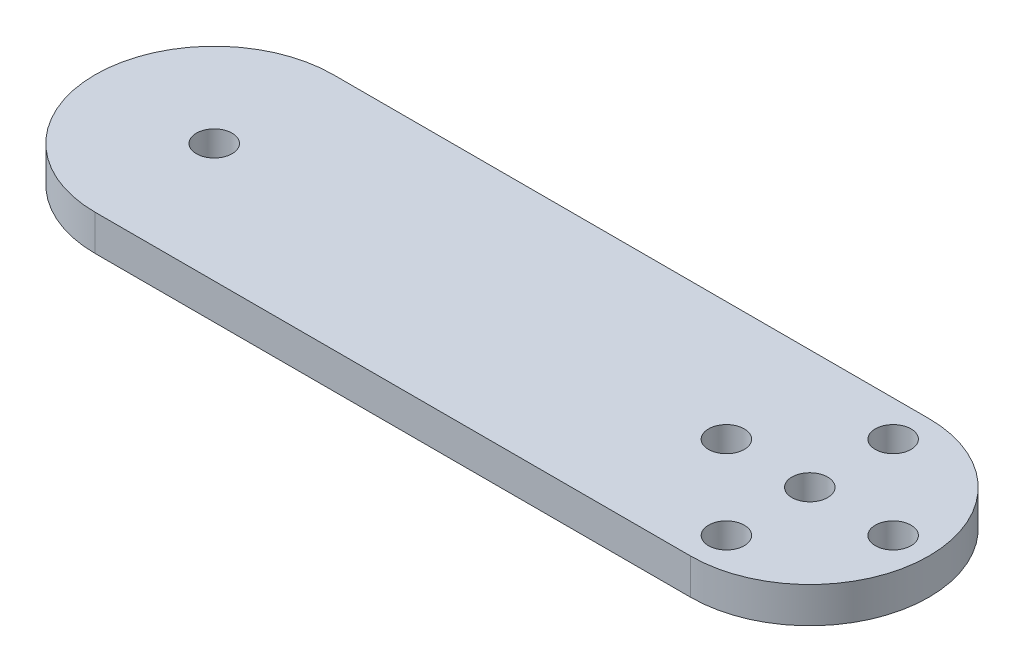
ISO-10303-21;
HEADER;
FILE_DESCRIPTION(('STEP AP214'),'2;1');
FILE_NAME('part.step','',(''),(''),'','','');
FILE_SCHEMA(('AUTOMOTIVE_DESIGN { 1 0 10303 214 1 1 1 1 }'));
ENDSEC;
DATA;
#1=APPLICATION_CONTEXT('core data for automotive mechanical design processes');
#2=APPLICATION_PROTOCOL_DEFINITION('international standard','automotive_design',2000,#1);
#3=PRODUCT_CONTEXT('',#1,'mechanical');
#4=PRODUCT('Part','Part','',(#3));
#5=PRODUCT_RELATED_PRODUCT_CATEGORY('part','',(#4));
#6=PRODUCT_DEFINITION_FORMATION('','',#4);
#7=PRODUCT_DEFINITION_CONTEXT('part definition',#1,'design');
#8=PRODUCT_DEFINITION('design','',#6,#7);
#9=PRODUCT_DEFINITION_SHAPE('','',#8);
#10=(LENGTH_UNIT() NAMED_UNIT(*) SI_UNIT(.MILLI.,.METRE.));
#11=(NAMED_UNIT(*) PLANE_ANGLE_UNIT() SI_UNIT($,.RADIAN.));
#12=(NAMED_UNIT(*) SI_UNIT($,.STERADIAN.) SOLID_ANGLE_UNIT());
#13=UNCERTAINTY_MEASURE_WITH_UNIT(LENGTH_MEASURE(1.E-05),#10,'distance_accuracy_value','');
#14=(GEOMETRIC_REPRESENTATION_CONTEXT(3) GLOBAL_UNCERTAINTY_ASSIGNED_CONTEXT((#13)) GLOBAL_UNIT_ASSIGNED_CONTEXT((#10,
#11,#12)) REPRESENTATION_CONTEXT('',''));
#15=CARTESIAN_POINT('',(0.,0.,0.));
#16=DIRECTION('',(0.,0.,1.));
#17=DIRECTION('',(1.,0.,0.));
#18=AXIS2_PLACEMENT_3D('',#15,#16,#17);
#19=CARTESIAN_POINT('',(0.,3.,-10.));
#20=DIRECTION('',(0.,1.,0.));
#21=DIRECTION('',(0.,0.,1.));
#22=AXIS2_PLACEMENT_3D('',#19,#20,#21);
#23=PLANE('',#22);
#24=CARTESIAN_POINT('',(-7.,3.,-10.));
#25=DIRECTION('',(0.,-1.,0.));
#26=DIRECTION('',(0.,0.,-1.));
#27=AXIS2_PLACEMENT_3D('',#24,#25,#26);
#28=CIRCLE('',#27,1.5);
#29=CARTESIAN_POINT('',(-7.,3.,-11.5));
#30=VERTEX_POINT('',#29);
#31=EDGE_CURVE('E226',#30,#30,#28,.T.);
#32=ORIENTED_EDGE('',*,*,#31,.T.);
#33=EDGE_LOOP('',(#32));
#34=FACE_BOUND('',#33,.T.);
#35=CARTESIAN_POINT('',(7.,3.,-10.));
#36=DIRECTION('',(0.,1.,0.));
#37=DIRECTION('',(0.,0.,1.));
#38=AXIS2_PLACEMENT_3D('',#35,#36,#37);
#39=CIRCLE('',#38,1.5);
#40=CARTESIAN_POINT('',(7.,3.,-8.5));
#41=VERTEX_POINT('',#40);
#42=EDGE_CURVE('E214',#41,#41,#39,.T.);
#43=ORIENTED_EDGE('',*,*,#42,.F.);
#44=EDGE_LOOP('',(#43));
#45=FACE_BOUND('',#44,.T.);
#46=CARTESIAN_POINT('',(-50.,3.,-9.99999999999999));
#47=DIRECTION('',(0.,1.,0.));
#48=DIRECTION('',(0.,0.,1.));
#49=AXIS2_PLACEMENT_3D('',#46,#47,#48);
#50=CIRCLE('',#49,1.5);
#51=CARTESIAN_POINT('',(-50.,3.,-8.49999999999999));
#52=VERTEX_POINT('',#51);
#53=EDGE_CURVE('E189',#52,#52,#50,.T.);
#54=ORIENTED_EDGE('',*,*,#53,.F.);
#55=EDGE_LOOP('',(#54));
#56=FACE_BOUND('',#55,.T.);
#57=CARTESIAN_POINT('',(0.,3.,-10.));
#58=DIRECTION('',(0.,1.,0.));
#59=DIRECTION('',(0.,0.,1.));
#60=AXIS2_PLACEMENT_3D('',#57,#58,#59);
#61=CIRCLE('',#60,10.);
#62=CARTESIAN_POINT('',(0.,3.,0.));
#63=VERTEX_POINT('',#62);
#64=CARTESIAN_POINT('',(0.,3.,-20.));
#65=VERTEX_POINT('',#64);
#66=EDGE_CURVE('E173',#63,#65,#61,.T.);
#67=ORIENTED_EDGE('',*,*,#66,.T.);
#68=DIRECTION('',(-1.,0.,0.));
#69=VECTOR('',#68,1.);
#70=CARTESIAN_POINT('',(0.,3.,-20.));
#71=LINE('',#70,#69);
#72=CARTESIAN_POINT('',(-50.,3.,-20.));
#73=VERTEX_POINT('',#72);
#74=EDGE_CURVE('E165',#65,#73,#71,.T.);
#75=ORIENTED_EDGE('',*,*,#74,.T.);
#76=CARTESIAN_POINT('',(-50.,3.,-9.99999999999999));
#77=DIRECTION('',(0.,-1.,0.));
#78=DIRECTION('',(0.,0.,-1.));
#79=AXIS2_PLACEMENT_3D('',#76,#77,#78);
#80=CIRCLE('',#79,10.);
#81=CARTESIAN_POINT('',(-50.,3.,0.));
#82=VERTEX_POINT('',#81);
#83=EDGE_CURVE('E172',#82,#73,#80,.T.);
#84=ORIENTED_EDGE('',*,*,#83,.F.);
#85=DIRECTION('',(-1.,0.,0.));
#86=VECTOR('',#85,1.);
#87=CARTESIAN_POINT('',(0.,3.,0.));
#88=LINE('',#87,#86);
#89=EDGE_CURVE('E182',#63,#82,#88,.T.);
#90=ORIENTED_EDGE('',*,*,#89,.F.);
#91=EDGE_LOOP('',(#67,#75,#84,#90));
#92=FACE_BOUND('',#91,.T.);
#93=CARTESIAN_POINT('',(0.,3.,-3.));
#94=DIRECTION('',(0.,-1.,0.));
#95=DIRECTION('',(0.,0.,-1.));
#96=AXIS2_PLACEMENT_3D('',#93,#94,#95);
#97=CIRCLE('',#96,1.5);
#98=CARTESIAN_POINT('',(0.,3.,-4.5));
#99=VERTEX_POINT('',#98);
#100=EDGE_CURVE('E202',#99,#99,#97,.T.);
#101=ORIENTED_EDGE('',*,*,#100,.T.);
#102=EDGE_LOOP('',(#101));
#103=FACE_BOUND('',#102,.T.);
#104=CARTESIAN_POINT('',(0.,3.,-10.));
#105=DIRECTION('',(0.,1.,0.));
#106=DIRECTION('',(0.,0.,1.));
#107=AXIS2_PLACEMENT_3D('',#104,#105,#106);
#108=CIRCLE('',#107,1.5);
#109=CARTESIAN_POINT('',(0.,3.,-8.5));
#110=VERTEX_POINT('',#109);
#111=EDGE_CURVE('E208',#110,#110,#108,.T.);
#112=ORIENTED_EDGE('',*,*,#111,.F.);
#113=EDGE_LOOP('',(#112));
#114=FACE_BOUND('',#113,.T.);
#115=CARTESIAN_POINT('',(0.,3.,-17.));
#116=DIRECTION('',(0.,1.,0.));
#117=DIRECTION('',(0.,0.,1.));
#118=AXIS2_PLACEMENT_3D('',#115,#116,#117);
#119=CIRCLE('',#118,1.5);
#120=CARTESIAN_POINT('',(0.,3.,-15.5));
#121=VERTEX_POINT('',#120);
#122=EDGE_CURVE('E220',#121,#121,#119,.T.);
#123=ORIENTED_EDGE('',*,*,#122,.F.);
#124=EDGE_LOOP('',(#123));
#125=FACE_BOUND('',#124,.T.);
#126=ADVANCED_FACE('F123',(#34,#45,#56,#92,#103,#114,#125),#23,.T.);
#127=CARTESIAN_POINT('',(0.,0.,-10.));
#128=DIRECTION('',(0.,1.,0.));
#129=DIRECTION('',(0.,0.,1.));
#130=AXIS2_PLACEMENT_3D('',#127,#128,#129);
#131=PLANE('',#130);
#132=CARTESIAN_POINT('',(-7.,0.,-10.));
#133=DIRECTION('',(0.,-1.,0.));
#134=DIRECTION('',(0.,0.,-1.));
#135=AXIS2_PLACEMENT_3D('',#132,#133,#134);
#136=CIRCLE('',#135,1.5);
#137=CARTESIAN_POINT('',(-7.,0.,-11.5));
#138=VERTEX_POINT('',#137);
#139=EDGE_CURVE('E229',#138,#138,#136,.T.);
#140=ORIENTED_EDGE('',*,*,#139,.F.);
#141=EDGE_LOOP('',(#140));
#142=FACE_BOUND('',#141,.T.);
#143=CARTESIAN_POINT('',(0.,0.,-3.));
#144=DIRECTION('',(0.,-1.,0.));
#145=DIRECTION('',(0.,0.,-1.));
#146=AXIS2_PLACEMENT_3D('',#143,#144,#145);
#147=CIRCLE('',#146,1.5);
#148=CARTESIAN_POINT('',(0.,0.,-4.5));
#149=VERTEX_POINT('',#148);
#150=EDGE_CURVE('E205',#149,#149,#147,.T.);
#151=ORIENTED_EDGE('',*,*,#150,.F.);
#152=EDGE_LOOP('',(#151));
#153=FACE_BOUND('',#152,.T.);
#154=CARTESIAN_POINT('',(0.,0.,-10.));
#155=DIRECTION('',(0.,1.,0.));
#156=DIRECTION('',(0.,0.,1.));
#157=AXIS2_PLACEMENT_3D('',#154,#155,#156);
#158=CIRCLE('',#157,10.);
#159=CARTESIAN_POINT('',(0.,0.,0.));
#160=VERTEX_POINT('',#159);
#161=CARTESIAN_POINT('',(0.,0.,-20.));
#162=VERTEX_POINT('',#161);
#163=EDGE_CURVE('E187',#160,#162,#158,.T.);
#164=ORIENTED_EDGE('',*,*,#163,.F.);
#165=DIRECTION('',(-1.,0.,0.));
#166=VECTOR('',#165,1.);
#167=CARTESIAN_POINT('',(0.,0.,0.));
#168=LINE('',#167,#166);
#169=CARTESIAN_POINT('',(-50.,0.,0.));
#170=VERTEX_POINT('',#169);
#171=EDGE_CURVE('E193',#160,#170,#168,.T.);
#172=ORIENTED_EDGE('',*,*,#171,.T.);
#173=CARTESIAN_POINT('',(-50.,0.,-9.99999999999999));
#174=DIRECTION('',(0.,-1.,0.));
#175=DIRECTION('',(0.,0.,-1.));
#176=AXIS2_PLACEMENT_3D('',#173,#174,#175);
#177=CIRCLE('',#176,10.);
#178=CARTESIAN_POINT('',(-50.,0.,-20.));
#179=VERTEX_POINT('',#178);
#180=EDGE_CURVE('E191',#170,#179,#177,.T.);
#181=ORIENTED_EDGE('',*,*,#180,.T.);
#182=DIRECTION('',(-1.,0.,0.));
#183=VECTOR('',#182,1.);
#184=CARTESIAN_POINT('',(0.,0.,-20.));
#185=LINE('',#184,#183);
#186=EDGE_CURVE('E178',#162,#179,#185,.T.);
#187=ORIENTED_EDGE('',*,*,#186,.F.);
#188=EDGE_LOOP('',(#164,#172,#181,#187));
#189=FACE_BOUND('',#188,.T.);
#190=CARTESIAN_POINT('',(-50.,0.,-9.99999999999999));
#191=DIRECTION('',(0.,1.,0.));
#192=DIRECTION('',(0.,0.,1.));
#193=AXIS2_PLACEMENT_3D('',#190,#191,#192);
#194=CIRCLE('',#193,1.5);
#195=CARTESIAN_POINT('',(-50.,0.,-8.49999999999999));
#196=VERTEX_POINT('',#195);
#197=EDGE_CURVE('E199',#196,#196,#194,.T.);
#198=ORIENTED_EDGE('',*,*,#197,.T.);
#199=EDGE_LOOP('',(#198));
#200=FACE_BOUND('',#199,.T.);
#201=CARTESIAN_POINT('',(0.,0.,-10.));
#202=DIRECTION('',(0.,1.,0.));
#203=DIRECTION('',(0.,0.,1.));
#204=AXIS2_PLACEMENT_3D('',#201,#202,#203);
#205=CIRCLE('',#204,1.5);
#206=CARTESIAN_POINT('',(0.,0.,-8.5));
#207=VERTEX_POINT('',#206);
#208=EDGE_CURVE('E211',#207,#207,#205,.T.);
#209=ORIENTED_EDGE('',*,*,#208,.T.);
#210=EDGE_LOOP('',(#209));
#211=FACE_BOUND('',#210,.T.);
#212=CARTESIAN_POINT('',(7.,0.,-10.));
#213=DIRECTION('',(0.,1.,0.));
#214=DIRECTION('',(0.,0.,1.));
#215=AXIS2_PLACEMENT_3D('',#212,#213,#214);
#216=CIRCLE('',#215,1.5);
#217=CARTESIAN_POINT('',(7.,0.,-8.5));
#218=VERTEX_POINT('',#217);
#219=EDGE_CURVE('E217',#218,#218,#216,.T.);
#220=ORIENTED_EDGE('',*,*,#219,.T.);
#221=EDGE_LOOP('',(#220));
#222=FACE_BOUND('',#221,.T.);
#223=CARTESIAN_POINT('',(0.,0.,-17.));
#224=DIRECTION('',(0.,1.,0.));
#225=DIRECTION('',(0.,0.,1.));
#226=AXIS2_PLACEMENT_3D('',#223,#224,#225);
#227=CIRCLE('',#226,1.5);
#228=CARTESIAN_POINT('',(0.,0.,-15.5));
#229=VERTEX_POINT('',#228);
#230=EDGE_CURVE('E223',#229,#229,#227,.T.);
#231=ORIENTED_EDGE('',*,*,#230,.T.);
#232=EDGE_LOOP('',(#231));
#233=FACE_BOUND('',#232,.T.);
#234=ADVANCED_FACE('F244',(#142,#153,#189,#200,#211,#222,#233),#131,.F.);
#235=CARTESIAN_POINT('',(0.,3.,-10.));
#236=DIRECTION('',(0.,-1.,0.));
#237=DIRECTION('',(0.,0.,-1.));
#238=AXIS2_PLACEMENT_3D('',#235,#236,#237);
#239=CYLINDRICAL_SURFACE('',#238,10.);
#240=ORIENTED_EDGE('',*,*,#163,.T.);
#241=DIRECTION('',(0.,-1.,0.));
#242=VECTOR('',#241,1.);
#243=CARTESIAN_POINT('',(0.,3.,-20.));
#244=LINE('',#243,#242);
#245=EDGE_CURVE('E12',#65,#162,#244,.T.);
#246=ORIENTED_EDGE('',*,*,#245,.F.);
#247=ORIENTED_EDGE('',*,*,#66,.F.);
#248=DIRECTION('',(0.,-1.,0.));
#249=VECTOR('',#248,1.);
#250=CARTESIAN_POINT('',(0.,3.,0.));
#251=LINE('',#250,#249);
#252=EDGE_CURVE('E140',#63,#160,#251,.T.);
#253=ORIENTED_EDGE('',*,*,#252,.T.);
#254=EDGE_LOOP('',(#240,#246,#247,#253));
#255=FACE_BOUND('',#254,.T.);
#256=ADVANCED_FACE('F125',(#255),#239,.T.);
#257=CARTESIAN_POINT('',(0.,3.,-20.));
#258=DIRECTION('',(0.,0.,1.));
#259=DIRECTION('',(1.,0.,0.));
#260=AXIS2_PLACEMENT_3D('',#257,#258,#259);
#261=PLANE('',#260);
#262=ORIENTED_EDGE('',*,*,#186,.T.);
#263=DIRECTION('',(0.,-1.,0.));
#264=VECTOR('',#263,1.);
#265=CARTESIAN_POINT('',(-50.,3.,-20.));
#266=LINE('',#265,#264);
#267=EDGE_CURVE('E132',#73,#179,#266,.T.);
#268=ORIENTED_EDGE('',*,*,#267,.F.);
#269=ORIENTED_EDGE('',*,*,#74,.F.);
#270=ORIENTED_EDGE('',*,*,#245,.T.);
#271=EDGE_LOOP('',(#262,#268,#269,#270));
#272=FACE_BOUND('',#271,.T.);
#273=ADVANCED_FACE('F177',(#272),#261,.F.);
#274=CARTESIAN_POINT('',(-50.,3.,-9.99999999999999));
#275=DIRECTION('',(0.,-1.,0.));
#276=DIRECTION('',(0.,0.,-1.));
#277=AXIS2_PLACEMENT_3D('',#274,#275,#276);
#278=CYLINDRICAL_SURFACE('',#277,10.);
#279=ORIENTED_EDGE('',*,*,#180,.F.);
#280=DIRECTION('',(0.,-1.,0.));
#281=VECTOR('',#280,1.);
#282=CARTESIAN_POINT('',(-50.,3.,0.));
#283=LINE('',#282,#281);
#284=EDGE_CURVE('E154',#82,#170,#283,.T.);
#285=ORIENTED_EDGE('',*,*,#284,.F.);
#286=ORIENTED_EDGE('',*,*,#83,.T.);
#287=ORIENTED_EDGE('',*,*,#267,.T.);
#288=EDGE_LOOP('',(#279,#285,#286,#287));
#289=FACE_BOUND('',#288,.T.);
#290=ADVANCED_FACE('F181',(#289),#278,.T.);
#291=CARTESIAN_POINT('',(0.,3.,0.));
#292=DIRECTION('',(0.,0.,1.));
#293=DIRECTION('',(1.,0.,0.));
#294=AXIS2_PLACEMENT_3D('',#291,#292,#293);
#295=PLANE('',#294);
#296=ORIENTED_EDGE('',*,*,#171,.F.);
#297=ORIENTED_EDGE('',*,*,#252,.F.);
#298=ORIENTED_EDGE('',*,*,#89,.T.);
#299=ORIENTED_EDGE('',*,*,#284,.T.);
#300=EDGE_LOOP('',(#296,#297,#298,#299));
#301=FACE_BOUND('',#300,.T.);
#302=ADVANCED_FACE('F276',(#301),#295,.T.);
#303=CARTESIAN_POINT('',(-50.,3.,-9.99999999999999));
#304=DIRECTION('',(0.,-1.,0.));
#305=DIRECTION('',(0.,0.,-1.));
#306=AXIS2_PLACEMENT_3D('',#303,#304,#305);
#307=CYLINDRICAL_SURFACE('',#306,1.5);
#308=ORIENTED_EDGE('',*,*,#53,.T.);
#309=EDGE_LOOP('',(#308));
#310=FACE_BOUND('',#309,.T.);
#311=ORIENTED_EDGE('',*,*,#197,.F.);
#312=EDGE_LOOP('',(#311));
#313=FACE_BOUND('',#312,.T.);
#314=ADVANCED_FACE('F273',(#310,#313),#307,.F.);
#315=CARTESIAN_POINT('',(0.,3.,-3.));
#316=DIRECTION('',(0.,-1.,0.));
#317=DIRECTION('',(0.,0.,-1.));
#318=AXIS2_PLACEMENT_3D('',#315,#316,#317);
#319=CYLINDRICAL_SURFACE('',#318,1.5);
#320=ORIENTED_EDGE('',*,*,#100,.F.);
#321=EDGE_LOOP('',(#320));
#322=FACE_BOUND('',#321,.T.);
#323=ORIENTED_EDGE('',*,*,#150,.T.);
#324=EDGE_LOOP('',(#323));
#325=FACE_BOUND('',#324,.T.);
#326=ADVANCED_FACE('F320',(#322,#325),#319,.F.);
#327=CARTESIAN_POINT('',(0.,3.,-10.));
#328=DIRECTION('',(0.,-1.,0.));
#329=DIRECTION('',(0.,0.,-1.));
#330=AXIS2_PLACEMENT_3D('',#327,#328,#329);
#331=CYLINDRICAL_SURFACE('',#330,1.5);
#332=ORIENTED_EDGE('',*,*,#111,.T.);
#333=EDGE_LOOP('',(#332));
#334=FACE_BOUND('',#333,.T.);
#335=ORIENTED_EDGE('',*,*,#208,.F.);
#336=EDGE_LOOP('',(#335));
#337=FACE_BOUND('',#336,.T.);
#338=ADVANCED_FACE('F265',(#334,#337),#331,.F.);
#339=CARTESIAN_POINT('',(7.,3.,-10.));
#340=DIRECTION('',(0.,-1.,0.));
#341=DIRECTION('',(0.,0.,-1.));
#342=AXIS2_PLACEMENT_3D('',#339,#340,#341);
#343=CYLINDRICAL_SURFACE('',#342,1.5);
#344=ORIENTED_EDGE('',*,*,#42,.T.);
#345=EDGE_LOOP('',(#344));
#346=FACE_BOUND('',#345,.T.);
#347=ORIENTED_EDGE('',*,*,#219,.F.);
#348=EDGE_LOOP('',(#347));
#349=FACE_BOUND('',#348,.T.);
#350=ADVANCED_FACE('F259',(#346,#349),#343,.F.);
#351=CARTESIAN_POINT('',(0.,3.,-17.));
#352=DIRECTION('',(0.,-1.,0.));
#353=DIRECTION('',(0.,0.,-1.));
#354=AXIS2_PLACEMENT_3D('',#351,#352,#353);
#355=CYLINDRICAL_SURFACE('',#354,1.5);
#356=ORIENTED_EDGE('',*,*,#122,.T.);
#357=EDGE_LOOP('',(#356));
#358=FACE_BOUND('',#357,.T.);
#359=ORIENTED_EDGE('',*,*,#230,.F.);
#360=EDGE_LOOP('',(#359));
#361=FACE_BOUND('',#360,.T.);
#362=ADVANCED_FACE('F240',(#358,#361),#355,.F.);
#363=CARTESIAN_POINT('',(-7.,3.,-10.));
#364=DIRECTION('',(0.,-1.,0.));
#365=DIRECTION('',(0.,0.,-1.));
#366=AXIS2_PLACEMENT_3D('',#363,#364,#365);
#367=CYLINDRICAL_SURFACE('',#366,1.5);
#368=ORIENTED_EDGE('',*,*,#31,.F.);
#369=EDGE_LOOP('',(#368));
#370=FACE_BOUND('',#369,.T.);
#371=ORIENTED_EDGE('',*,*,#139,.T.);
#372=EDGE_LOOP('',(#371));
#373=FACE_BOUND('',#372,.T.);
#374=ADVANCED_FACE('F237',(#370,#373),#367,.F.);
#375=CLOSED_SHELL('',(#126,#234,#256,#273,#290,#302,#314,#326,#338,#350,#362,#374));
#376=MANIFOLD_SOLID_BREP('B2',#375);
#377=ADVANCED_BREP_SHAPE_REPRESENTATION('',(#18,#376),#14);
#378=SHAPE_DEFINITION_REPRESENTATION(#9,#377);
ENDSEC;
END-ISO-10303-21;
